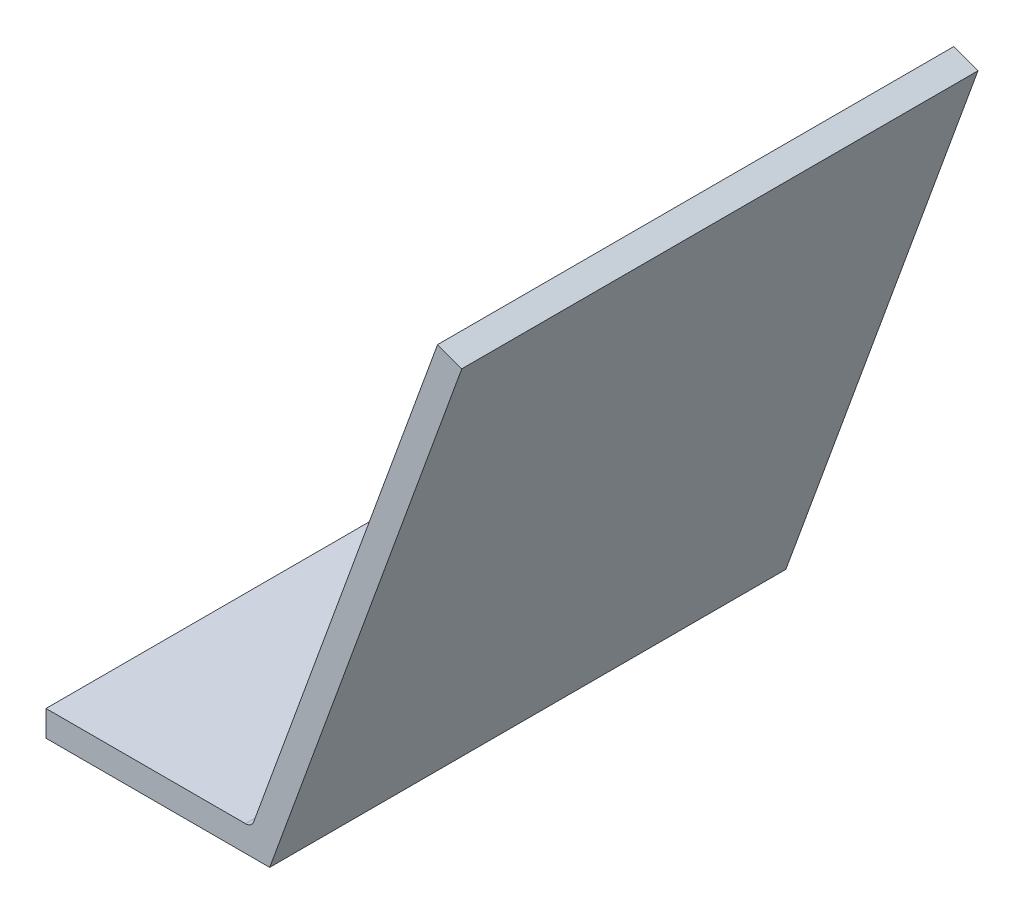
ISO-10303-21;
HEADER;
FILE_DESCRIPTION(('STEP AP214'),'2;1');
FILE_NAME('part.step','',(''),(''),'','','');
FILE_SCHEMA(('AUTOMOTIVE_DESIGN { 1 0 10303 214 1 1 1 1 }'));
ENDSEC;
DATA;
#1=APPLICATION_CONTEXT('core data for automotive mechanical design processes');
#2=APPLICATION_PROTOCOL_DEFINITION('international standard','automotive_design',2000,#1);
#3=PRODUCT_CONTEXT('',#1,'mechanical');
#4=PRODUCT('Part','Part','',(#3));
#5=PRODUCT_RELATED_PRODUCT_CATEGORY('part','',(#4));
#6=PRODUCT_DEFINITION_FORMATION('','',#4);
#7=PRODUCT_DEFINITION_CONTEXT('part definition',#1,'design');
#8=PRODUCT_DEFINITION('design','',#6,#7);
#9=PRODUCT_DEFINITION_SHAPE('','',#8);
#10=(LENGTH_UNIT() NAMED_UNIT(*) SI_UNIT(.MILLI.,.METRE.));
#11=(NAMED_UNIT(*) PLANE_ANGLE_UNIT() SI_UNIT($,.RADIAN.));
#12=(NAMED_UNIT(*) SI_UNIT($,.STERADIAN.) SOLID_ANGLE_UNIT());
#13=UNCERTAINTY_MEASURE_WITH_UNIT(LENGTH_MEASURE(1.E-05),#10,'distance_accuracy_value','');
#14=(GEOMETRIC_REPRESENTATION_CONTEXT(3) GLOBAL_UNCERTAINTY_ASSIGNED_CONTEXT((#13)) GLOBAL_UNIT_ASSIGNED_CONTEXT((#10,
#11,#12)) REPRESENTATION_CONTEXT('',''));
#15=CARTESIAN_POINT('',(0.,0.,0.));
#16=DIRECTION('',(0.,0.,1.));
#17=DIRECTION('',(1.,0.,0.));
#18=AXIS2_PLACEMENT_3D('',#15,#16,#17);
#19=CARTESIAN_POINT('',(72.71333527,-121.809856486,-10.));
#20=DIRECTION('',(-1.,0.,0.));
#21=DIRECTION('',(0.,0.,1.));
#22=AXIS2_PLACEMENT_3D('',#19,#20,#21);
#23=PLANE('',#22);
#24=DIRECTION('',(0.,0.,-1.));
#25=VECTOR('',#24,1.);
#26=CARTESIAN_POINT('',(72.71333527,-120.309856486,5.));
#27=LINE('',#26,#25);
#28=CARTESIAN_POINT('',(72.71333527,-120.309856483053,20.));
#29=VERTEX_POINT('',#28);
#30=CARTESIAN_POINT('',(72.71333527,-120.309856483053,-10.));
#31=VERTEX_POINT('',#30);
#32=EDGE_CURVE('E718',#29,#31,#27,.T.);
#33=ORIENTED_EDGE('',*,*,#32,.T.);
#34=DIRECTION('',(0.,-1.,0.));
#35=VECTOR('',#34,1.);
#36=CARTESIAN_POINT('',(72.71333527,-121.059856486,-10.));
#37=LINE('',#36,#35);
#38=CARTESIAN_POINT('',(72.71333527,-121.809856486,-10.));
#39=VERTEX_POINT('',#38);
#40=EDGE_CURVE('E183',#31,#39,#37,.T.);
#41=ORIENTED_EDGE('',*,*,#40,.T.);
#42=DIRECTION('',(0.,0.,-1.));
#43=VECTOR('',#42,1.);
#44=CARTESIAN_POINT('',(72.71333527,-121.809856486,5.));
#45=LINE('',#44,#43);
#46=CARTESIAN_POINT('',(72.71333527,-121.809856486,20.));
#47=VERTEX_POINT('',#46);
#48=EDGE_CURVE('E659',#47,#39,#45,.T.);
#49=ORIENTED_EDGE('',*,*,#48,.F.);
#50=DIRECTION('',(0.,1.,0.));
#51=VECTOR('',#50,1.);
#52=CARTESIAN_POINT('',(72.71333527,-121.059856486,20.));
#53=LINE('',#52,#51);
#54=EDGE_CURVE('E181',#47,#29,#53,.T.);
#55=ORIENTED_EDGE('',*,*,#54,.T.);
#56=EDGE_LOOP('',(#33,#41,#49,#55));
#57=FACE_BOUND('',#56,.T.);
#58=ADVANCED_FACE('F20',(#57),#23,.T.);
#59=CARTESIAN_POINT('',(72.71333527,-120.309856486,20.));
#60=DIRECTION('',(0.,-1.,0.));
#61=DIRECTION('',(0.,0.,-1.));
#62=AXIS2_PLACEMENT_3D('',#59,#60,#61);
#63=PLANE('',#62);
#64=DIRECTION('',(-1.,0.,0.));
#65=VECTOR('',#64,1.);
#66=CARTESIAN_POINT('',(84.8688584055,-120.30985647716,20.));
#67=LINE('',#66,#65);
#68=CARTESIAN_POINT('',(84.3129201941026,-120.30985648158,20.));
#69=VERTEX_POINT('',#68);
#70=EDGE_CURVE('E680',#69,#29,#67,.T.);
#71=ORIENTED_EDGE('',*,*,#70,.F.);
#72=DIRECTION('',(0.,0.,-1.));
#73=VECTOR('',#72,1.);
#74=CARTESIAN_POINT('',(84.3129201942051,-120.309856486,5.));
#75=LINE('',#74,#73);
#76=CARTESIAN_POINT('',(84.3129201941026,-120.30985648158,-10.));
#77=VERTEX_POINT('',#76);
#78=EDGE_CURVE('E476',#77,#69,#75,.F.);
#79=ORIENTED_EDGE('',*,*,#78,.F.);
#80=DIRECTION('',(1.,0.,0.));
#81=VECTOR('',#80,1.);
#82=CARTESIAN_POINT('',(84.8688584055,-120.30985647716,-10.));
#83=LINE('',#82,#81);
#84=EDGE_CURVE('E116',#31,#77,#83,.T.);
#85=ORIENTED_EDGE('',*,*,#84,.F.);
#86=ORIENTED_EDGE('',*,*,#32,.F.);
#87=EDGE_LOOP('',(#71,#79,#85,#86));
#88=FACE_BOUND('',#87,.T.);
#89=ADVANCED_FACE('F742',(#88),#63,.F.);
#90=CARTESIAN_POINT('',(72.71333527,-121.809856486,20.));
#91=DIRECTION('',(0.,-1.,0.));
#92=DIRECTION('',(0.,0.,-1.));
#93=AXIS2_PLACEMENT_3D('',#90,#91,#92);
#94=PLANE('',#93);
#95=DIRECTION('',(-1.,0.,0.));
#96=VECTOR('',#95,1.);
#97=CARTESIAN_POINT('',(84.8688584055,-121.809856486,-10.));
#98=LINE('',#97,#96);
#99=CARTESIAN_POINT('',(85.7133352699477,-121.809856486,-10.));
#100=VERTEX_POINT('',#99);
#101=EDGE_CURVE('E658',#100,#39,#98,.T.);
#102=ORIENTED_EDGE('',*,*,#101,.F.);
#103=DIRECTION('',(0.,0.,-1.));
#104=VECTOR('',#103,1.);
#105=CARTESIAN_POINT('',(85.7133352699477,-121.809856486,20.));
#106=LINE('',#105,#104);
#107=CARTESIAN_POINT('',(85.7133352699477,-121.809856486,20.));
#108=VERTEX_POINT('',#107);
#109=EDGE_CURVE('E12',#100,#108,#106,.F.);
#110=ORIENTED_EDGE('',*,*,#109,.T.);
#111=DIRECTION('',(1.,0.,0.));
#112=VECTOR('',#111,1.);
#113=CARTESIAN_POINT('',(84.8688584055,-121.809856486,20.));
#114=LINE('',#113,#112);
#115=EDGE_CURVE('E109',#47,#108,#114,.T.);
#116=ORIENTED_EDGE('',*,*,#115,.F.);
#117=ORIENTED_EDGE('',*,*,#48,.T.);
#118=EDGE_LOOP('',(#102,#110,#116,#117));
#119=FACE_BOUND('',#118,.T.);
#120=ADVANCED_FACE('F799',(#119),#94,.T.);
#121=CARTESIAN_POINT('',(86.192305435,-120.493896773,20.));
#122=DIRECTION('',(0.939692620779762,-0.342020143342557,0.));
#123=DIRECTION('',(0.,0.,-1.));
#124=AXIS2_PLACEMENT_3D('',#121,#122,#123);
#125=PLANE('',#124);
#126=DIRECTION('',(0.,0.,-1.));
#127=VECTOR('',#126,1.);
#128=CARTESIAN_POINT('',(96.879385242,-91.131386325,5.));
#129=LINE('',#128,#127);
#130=CARTESIAN_POINT('',(96.8793852372776,-91.1313863304625,20.));
#131=VERTEX_POINT('',#130);
#132=CARTESIAN_POINT('',(96.8793852403904,-91.1313863244142,-10.));
#133=VERTEX_POINT('',#132);
#134=EDGE_CURVE('E87',#131,#133,#129,.T.);
#135=ORIENTED_EDGE('',*,*,#134,.F.);
#136=DIRECTION('',(0.342020143434306,0.939692620746368,0.));
#137=VECTOR('',#136,1.);
#138=CARTESIAN_POINT('',(86.1923054276391,-120.493896774288,20.));
#139=LINE('',#138,#137);
#140=EDGE_CURVE('E36',#108,#131,#139,.T.);
#141=ORIENTED_EDGE('',*,*,#140,.F.);
#142=ORIENTED_EDGE('',*,*,#109,.F.);
#143=DIRECTION('',(-0.342020143434306,-0.939692620746368,0.));
#144=VECTOR('',#143,1.);
#145=CARTESIAN_POINT('',(96.8793852341648,-91.1313863365109,-10.));
#146=LINE('',#145,#144);
#147=EDGE_CURVE('E44',#133,#100,#146,.T.);
#148=ORIENTED_EDGE('',*,*,#147,.F.);
#149=EDGE_LOOP('',(#135,#141,#142,#148));
#150=FACE_BOUND('',#149,.T.);
#151=ADVANCED_FACE('F706',(#150),#125,.T.);
#152=CARTESIAN_POINT('',(84.312920194,-119.809856486,-10.));
#153=DIRECTION('',(0.,0.,1.));
#154=DIRECTION('',(1.,0.,0.));
#155=AXIS2_PLACEMENT_3D('',#152,#153,#154);
#156=CYLINDRICAL_SURFACE('',#155,0.5);
#157=CARTESIAN_POINT('',(84.312920194,-119.809856486,-10.));
#158=DIRECTION('',(0.,0.,1.));
#159=DIRECTION('',(1.,0.,0.));
#160=AXIS2_PLACEMENT_3D('',#157,#158,#159);
#161=CIRCLE('',#160,0.5);
#162=CARTESIAN_POINT('',(84.7827665040782,-119.980866557785,-10.));
#163=VERTEX_POINT('',#162);
#164=EDGE_CURVE('E101',#77,#163,#161,.T.);
#165=ORIENTED_EDGE('',*,*,#164,.F.);
#166=ORIENTED_EDGE('',*,*,#78,.T.);
#167=CARTESIAN_POINT('',(84.3129201940001,-119.809856486,20.));
#168=DIRECTION('',(0.,0.,1.));
#169=DIRECTION('',(1.,0.,0.));
#170=AXIS2_PLACEMENT_3D('',#167,#168,#169);
#171=CIRCLE('',#170,0.5);
#172=CARTESIAN_POINT('',(84.7827665040782,-119.980866557785,20.));
#173=VERTEX_POINT('',#172);
#174=EDGE_CURVE('E684',#173,#69,#171,.F.);
#175=ORIENTED_EDGE('',*,*,#174,.F.);
#176=DIRECTION('',(0.,0.,-1.));
#177=VECTOR('',#176,1.);
#178=CARTESIAN_POINT('',(84.782766504,-119.980866558,5.));
#179=LINE('',#178,#177);
#180=EDGE_CURVE('E103',#173,#163,#179,.T.);
#181=ORIENTED_EDGE('',*,*,#180,.T.);
#182=EDGE_LOOP('',(#165,#166,#175,#181));
#183=FACE_BOUND('',#182,.T.);
#184=ADVANCED_FACE('F821',(#183),#156,.F.);
#185=CARTESIAN_POINT('',(97.024381541,-121.809856486,-10.));
#186=DIRECTION('',(0.,0.,-1.));
#187=DIRECTION('',(-1.,0.,0.));
#188=AXIS2_PLACEMENT_3D('',#185,#186,#187);
#189=PLANE('',#188);
#190=ORIENTED_EDGE('',*,*,#164,.T.);
#191=DIRECTION('',(0.342020143314298,0.939692620790047,0.));
#192=VECTOR('',#191,1.);
#193=CARTESIAN_POINT('',(90.126306407,-105.299611334,-10.));
#194=LINE('',#193,#192);
#195=CARTESIAN_POINT('',(95.46984631,-90.61835611,-10.));
#196=VERTEX_POINT('',#195);
#197=EDGE_CURVE('E94',#163,#196,#194,.T.);
#198=ORIENTED_EDGE('',*,*,#197,.T.);
#199=DIRECTION('',(-0.939692620847478,0.342020143156508,0.));
#200=VECTOR('',#199,1.);
#201=CARTESIAN_POINT('',(96.174615776,-90.8748712175,-10.));
#202=LINE('',#201,#200);
#203=EDGE_CURVE('E82',#133,#196,#202,.T.);
#204=ORIENTED_EDGE('',*,*,#203,.F.);
#205=ORIENTED_EDGE('',*,*,#147,.T.);
#206=ORIENTED_EDGE('',*,*,#101,.T.);
#207=ORIENTED_EDGE('',*,*,#40,.F.);
#208=ORIENTED_EDGE('',*,*,#84,.T.);
#209=EDGE_LOOP('',(#190,#198,#204,#205,#206,#207,#208));
#210=FACE_BOUND('',#209,.T.);
#211=ADVANCED_FACE('F99',(#210),#189,.T.);
#212=CARTESIAN_POINT('',(96.879385242,-91.131386325,-10.));
#213=DIRECTION('',(0.342020143156508,0.939692620847478,0.));
#214=DIRECTION('',(-0.939692620847478,0.342020143156508,0.));
#215=AXIS2_PLACEMENT_3D('',#212,#213,#214);
#216=PLANE('',#215);
#217=ORIENTED_EDGE('',*,*,#134,.T.);
#218=ORIENTED_EDGE('',*,*,#203,.T.);
#219=DIRECTION('',(0.,0.,1.));
#220=VECTOR('',#219,1.);
#221=CARTESIAN_POINT('',(95.46984631,-90.61835611,5.));
#222=LINE('',#221,#220);
#223=CARTESIAN_POINT('',(95.4698463082792,-90.6183561147278,20.));
#224=VERTEX_POINT('',#223);
#225=EDGE_CURVE('E86',#196,#224,#222,.T.);
#226=ORIENTED_EDGE('',*,*,#225,.T.);
#227=DIRECTION('',(-0.93969262006449,0.342020145307748,0.));
#228=VECTOR('',#227,1.);
#229=CARTESIAN_POINT('',(96.8793852341648,-91.1313863365109,20.));
#230=LINE('',#229,#228);
#231=EDGE_CURVE('E692',#131,#224,#230,.T.);
#232=ORIENTED_EDGE('',*,*,#231,.F.);
#233=EDGE_LOOP('',(#217,#218,#226,#232));
#234=FACE_BOUND('',#233,.T.);
#235=ADVANCED_FACE('F84',(#234),#216,.T.);
#236=CARTESIAN_POINT('',(97.024381541,-90.431207108,20.));
#237=DIRECTION('',(0.,0.,1.));
#238=DIRECTION('',(-1.,0.,0.));
#239=AXIS2_PLACEMENT_3D('',#236,#237,#238);
#240=PLANE('',#239);
#241=ORIENTED_EDGE('',*,*,#54,.F.);
#242=ORIENTED_EDGE('',*,*,#115,.T.);
#243=ORIENTED_EDGE('',*,*,#140,.T.);
#244=ORIENTED_EDGE('',*,*,#231,.T.);
#245=DIRECTION('',(-0.342020143314298,-0.939692620790047,0.));
#246=VECTOR('',#245,1.);
#247=CARTESIAN_POINT('',(90.126306407,-105.299611334,20.));
#248=LINE('',#247,#246);
#249=EDGE_CURVE('E29',#224,#173,#248,.T.);
#250=ORIENTED_EDGE('',*,*,#249,.T.);
#251=ORIENTED_EDGE('',*,*,#174,.T.);
#252=ORIENTED_EDGE('',*,*,#70,.T.);
#253=EDGE_LOOP('',(#241,#242,#243,#244,#250,#251,#252));
#254=FACE_BOUND('',#253,.T.);
#255=ADVANCED_FACE('F704',(#254),#240,.T.);
#256=CARTESIAN_POINT('',(84.782766504,-119.980866558,20.));
#257=DIRECTION('',(0.939692620790047,-0.342020143314298,0.));
#258=DIRECTION('',(0.,0.,-1.));
#259=AXIS2_PLACEMENT_3D('',#256,#257,#258);
#260=PLANE('',#259);
#261=ORIENTED_EDGE('',*,*,#225,.F.);
#262=ORIENTED_EDGE('',*,*,#197,.F.);
#263=ORIENTED_EDGE('',*,*,#180,.F.);
#264=ORIENTED_EDGE('',*,*,#249,.F.);
#265=EDGE_LOOP('',(#261,#262,#263,#264));
#266=FACE_BOUND('',#265,.T.);
#267=ADVANCED_FACE('F22',(#266),#260,.F.);
#268=CLOSED_SHELL('',(#58,#89,#120,#151,#184,#211,#235,#255,#267));
#269=MANIFOLD_SOLID_BREP('B1',#268);
#270=ADVANCED_BREP_SHAPE_REPRESENTATION('',(#18,#269),#14);
#271=SHAPE_DEFINITION_REPRESENTATION(#9,#270);
ENDSEC;
END-ISO-10303-21;
